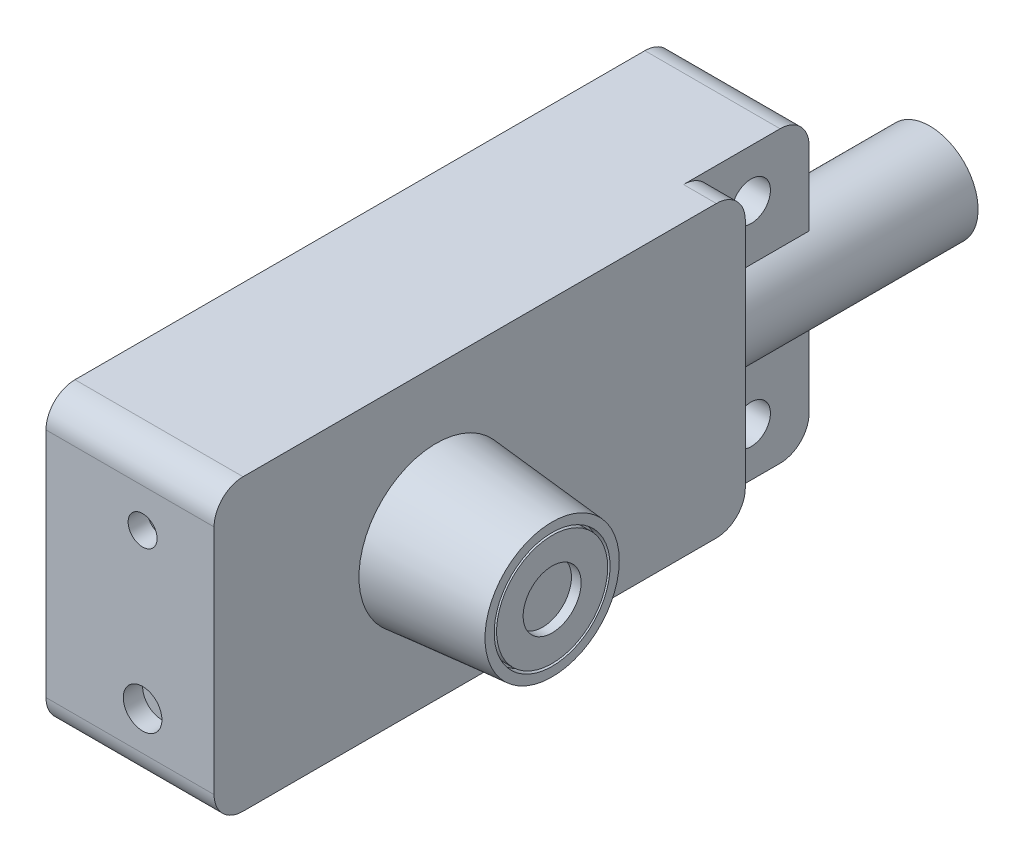
ISO-10303-21;
HEADER;
FILE_DESCRIPTION(('STEP AP214'),'2;1');
FILE_NAME('part.step','',(''),(''),'','','');
FILE_SCHEMA(('AUTOMOTIVE_DESIGN { 1 0 10303 214 1 1 1 1 }'));
ENDSEC;
DATA;
#1=APPLICATION_CONTEXT('core data for automotive mechanical design processes');
#2=APPLICATION_PROTOCOL_DEFINITION('international standard','automotive_design',2000,#1);
#3=PRODUCT_CONTEXT('',#1,'mechanical');
#4=PRODUCT('Part','Part','',(#3));
#5=PRODUCT_RELATED_PRODUCT_CATEGORY('part','',(#4));
#6=PRODUCT_DEFINITION_FORMATION('','',#4);
#7=PRODUCT_DEFINITION_CONTEXT('part definition',#1,'design');
#8=PRODUCT_DEFINITION('design','',#6,#7);
#9=PRODUCT_DEFINITION_SHAPE('','',#8);
#10=(LENGTH_UNIT() NAMED_UNIT(*) SI_UNIT(.MILLI.,.METRE.));
#11=(NAMED_UNIT(*) PLANE_ANGLE_UNIT() SI_UNIT($,.RADIAN.));
#12=(NAMED_UNIT(*) SI_UNIT($,.STERADIAN.) SOLID_ANGLE_UNIT());
#13=UNCERTAINTY_MEASURE_WITH_UNIT(LENGTH_MEASURE(1.E-05),#10,'distance_accuracy_value','');
#14=(GEOMETRIC_REPRESENTATION_CONTEXT(3) GLOBAL_UNCERTAINTY_ASSIGNED_CONTEXT((#13)) GLOBAL_UNIT_ASSIGNED_CONTEXT((#10,
#11,#12)) REPRESENTATION_CONTEXT('',''));
#15=CARTESIAN_POINT('',(0.,0.,0.));
#16=DIRECTION('',(0.,0.,1.));
#17=DIRECTION('',(1.,0.,0.));
#18=AXIS2_PLACEMENT_3D('',#15,#16,#17);
#19=CARTESIAN_POINT('',(0.,0.,-15.));
#20=DIRECTION('',(0.,0.,-1.));
#21=DIRECTION('',(-1.,0.,0.));
#22=AXIS2_PLACEMENT_3D('',#19,#20,#21);
#23=PLANE('',#22);
#24=CARTESIAN_POINT('',(11.5,15.,-15.));
#25=DIRECTION('',(0.,0.,-1.));
#26=DIRECTION('',(-1.,0.,0.));
#27=AXIS2_PLACEMENT_3D('',#24,#25,#26);
#28=CIRCLE('',#27,5.);
#29=CARTESIAN_POINT('',(6.5,15.,-15.));
#30=VERTEX_POINT('',#29);
#31=EDGE_CURVE('E27',#30,#30,#28,.T.);
#32=ORIENTED_EDGE('',*,*,#31,.T.);
#33=EDGE_LOOP('',(#32));
#34=FACE_BOUND('',#33,.T.);
#35=ADVANCED_FACE('F16',(#34),#23,.T.);
#36=CARTESIAN_POINT('',(11.5,15.,0.));
#37=DIRECTION('',(0.,0.,-1.));
#38=DIRECTION('',(-1.,0.,0.));
#39=AXIS2_PLACEMENT_3D('',#36,#37,#38);
#40=CYLINDRICAL_SURFACE('',#39,5.);
#41=ORIENTED_EDGE('',*,*,#31,.F.);
#42=EDGE_LOOP('',(#41));
#43=FACE_BOUND('',#42,.T.);
#44=CARTESIAN_POINT('',(11.5,15.,0.));
#45=DIRECTION('',(0.,0.,-1.));
#46=DIRECTION('',(-1.,0.,0.));
#47=AXIS2_PLACEMENT_3D('',#44,#45,#46);
#48=CIRCLE('',#47,5.);
#49=CARTESIAN_POINT('',(14.,10.6698729810778,0.));
#50=VERTEX_POINT('',#49);
#51=CARTESIAN_POINT('',(14.,19.3301270189222,0.));
#52=VERTEX_POINT('',#51);
#53=EDGE_CURVE('E36',#50,#52,#48,.T.);
#54=ORIENTED_EDGE('',*,*,#53,.T.);
#55=DIRECTION('',(0.,0.,1.));
#56=VECTOR('',#55,1.);
#57=CARTESIAN_POINT('',(14.,19.3301270189222,0.));
#58=LINE('',#57,#56);
#59=CARTESIAN_POINT('',(14.,19.3301270189222,10.));
#60=VERTEX_POINT('',#59);
#61=EDGE_CURVE('E131',#52,#60,#58,.T.);
#62=ORIENTED_EDGE('',*,*,#61,.T.);
#63=CARTESIAN_POINT('',(11.5,15.,10.));
#64=DIRECTION('',(0.,0.,-1.));
#65=DIRECTION('',(-1.,0.,0.));
#66=AXIS2_PLACEMENT_3D('',#63,#64,#65);
#67=CIRCLE('',#66,5.);
#68=CARTESIAN_POINT('',(14.,10.6698729810778,10.));
#69=VERTEX_POINT('',#68);
#70=EDGE_CURVE('E353',#60,#69,#67,.T.);
#71=ORIENTED_EDGE('',*,*,#70,.T.);
#72=DIRECTION('',(0.,0.,1.));
#73=VECTOR('',#72,1.);
#74=CARTESIAN_POINT('',(14.,10.6698729810778,0.));
#75=LINE('',#74,#73);
#76=EDGE_CURVE('E10',#50,#69,#75,.T.);
#77=ORIENTED_EDGE('',*,*,#76,.F.);
#78=EDGE_LOOP('',(#54,#62,#71,#77));
#79=FACE_BOUND('',#78,.T.);
#80=ADVANCED_FACE('F205',(#43,#79),#40,.T.);
#81=CARTESIAN_POINT('',(29.4,0.,0.));
#82=DIRECTION('',(1.,0.,0.));
#83=DIRECTION('',(0.,0.,-1.));
#84=AXIS2_PLACEMENT_3D('',#81,#82,#83);
#85=PLANE('',#84);
#86=CARTESIAN_POINT('',(29.4,15.,42.));
#87=DIRECTION('',(1.,0.,0.));
#88=DIRECTION('',(0.,0.,-1.));
#89=AXIS2_PLACEMENT_3D('',#86,#87,#88);
#90=CIRCLE('',#89,5.75);
#91=CARTESIAN_POINT('',(29.4,15.,36.25));
#92=VERTEX_POINT('',#91);
#93=EDGE_CURVE('E354',#92,#92,#90,.T.);
#94=ORIENTED_EDGE('',*,*,#93,.T.);
#95=EDGE_LOOP('',(#94));
#96=FACE_BOUND('',#95,.T.);
#97=CARTESIAN_POINT('',(29.4,15.,42.));
#98=DIRECTION('',(1.,0.,0.));
#99=DIRECTION('',(0.,0.,-1.));
#100=AXIS2_PLACEMENT_3D('',#97,#98,#99);
#101=CIRCLE('',#100,3.);
#102=CARTESIAN_POINT('',(29.4,15.,39.));
#103=VERTEX_POINT('',#102);
#104=EDGE_CURVE('E358',#103,#103,#101,.T.);
#105=ORIENTED_EDGE('',*,*,#104,.F.);
#106=EDGE_LOOP('',(#105));
#107=FACE_BOUND('',#106,.T.);
#108=ADVANCED_FACE('F211',(#96,#107),#85,.T.);
#109=CARTESIAN_POINT('',(28.9,15.,42.));
#110=DIRECTION('',(1.,0.,0.));
#111=DIRECTION('',(0.,0.,-1.));
#112=AXIS2_PLACEMENT_3D('',#109,#110,#111);
#113=CYLINDRICAL_SURFACE('',#112,5.75);
#114=CARTESIAN_POINT('',(28.4,15.,42.));
#115=DIRECTION('',(1.,0.,0.));
#116=DIRECTION('',(0.,0.,-1.));
#117=AXIS2_PLACEMENT_3D('',#114,#115,#116);
#118=CIRCLE('',#117,5.75);
#119=CARTESIAN_POINT('',(28.4,15.,36.25));
#120=VERTEX_POINT('',#119);
#121=EDGE_CURVE('E363',#120,#120,#118,.T.);
#122=ORIENTED_EDGE('',*,*,#121,.T.);
#123=EDGE_LOOP('',(#122));
#124=FACE_BOUND('',#123,.T.);
#125=ORIENTED_EDGE('',*,*,#93,.F.);
#126=EDGE_LOOP('',(#125));
#127=FACE_BOUND('',#126,.T.);
#128=ADVANCED_FACE('F218',(#124,#127),#113,.T.);
#129=CARTESIAN_POINT('',(28.9,15.,42.));
#130=DIRECTION('',(1.,0.,0.));
#131=DIRECTION('',(0.,0.,-1.));
#132=AXIS2_PLACEMENT_3D('',#129,#130,#131);
#133=CYLINDRICAL_SURFACE('',#132,3.);
#134=CARTESIAN_POINT('',(28.4,15.,42.));
#135=DIRECTION('',(1.,0.,0.));
#136=DIRECTION('',(0.,0.,-1.));
#137=AXIS2_PLACEMENT_3D('',#134,#135,#136);
#138=CIRCLE('',#137,3.);
#139=CARTESIAN_POINT('',(28.4,15.,39.));
#140=VERTEX_POINT('',#139);
#141=EDGE_CURVE('E359',#140,#140,#138,.T.);
#142=ORIENTED_EDGE('',*,*,#141,.F.);
#143=EDGE_LOOP('',(#142));
#144=FACE_BOUND('',#143,.T.);
#145=ORIENTED_EDGE('',*,*,#104,.T.);
#146=EDGE_LOOP('',(#145));
#147=FACE_BOUND('',#146,.T.);
#148=ADVANCED_FACE('F222',(#144,#147),#133,.F.);
#149=CARTESIAN_POINT('',(28.4,0.,0.));
#150=DIRECTION('',(1.,0.,0.));
#151=DIRECTION('',(0.,0.,-1.));
#152=AXIS2_PLACEMENT_3D('',#149,#150,#151);
#153=PLANE('',#152);
#154=CARTESIAN_POINT('',(28.4,15.,42.));
#155=DIRECTION('',(1.,0.,0.));
#156=DIRECTION('',(0.,0.,-1.));
#157=AXIS2_PLACEMENT_3D('',#154,#155,#156);
#158=CIRCLE('',#157,6.);
#159=CARTESIAN_POINT('',(28.4,15.,36.));
#160=VERTEX_POINT('',#159);
#161=EDGE_CURVE('E367',#160,#160,#158,.T.);
#162=ORIENTED_EDGE('',*,*,#161,.T.);
#163=EDGE_LOOP('',(#162));
#164=FACE_BOUND('',#163,.T.);
#165=ORIENTED_EDGE('',*,*,#121,.F.);
#166=EDGE_LOOP('',(#165));
#167=FACE_BOUND('',#166,.T.);
#168=ADVANCED_FACE('F226',(#164,#167),#153,.T.);
#169=CARTESIAN_POINT('',(28.4,0.,0.));
#170=DIRECTION('',(1.,0.,0.));
#171=DIRECTION('',(0.,0.,-1.));
#172=AXIS2_PLACEMENT_3D('',#169,#170,#171);
#173=PLANE('',#172);
#174=ORIENTED_EDGE('',*,*,#141,.T.);
#175=EDGE_LOOP('',(#174));
#176=FACE_BOUND('',#175,.T.);
#177=ADVANCED_FACE('F230',(#176),#173,.T.);
#178=CARTESIAN_POINT('',(28.9,15.,42.));
#179=DIRECTION('',(1.,0.,0.));
#180=DIRECTION('',(0.,0.,-1.));
#181=AXIS2_PLACEMENT_3D('',#178,#179,#180);
#182=CYLINDRICAL_SURFACE('',#181,6.);
#183=ORIENTED_EDGE('',*,*,#161,.F.);
#184=EDGE_LOOP('',(#183));
#185=FACE_BOUND('',#184,.T.);
#186=CARTESIAN_POINT('',(29.4,15.,42.));
#187=DIRECTION('',(1.,0.,0.));
#188=DIRECTION('',(0.,0.,-1.));
#189=AXIS2_PLACEMENT_3D('',#186,#187,#188);
#190=CIRCLE('',#189,6.);
#191=CARTESIAN_POINT('',(29.4,15.,36.));
#192=VERTEX_POINT('',#191);
#193=EDGE_CURVE('E374',#192,#192,#190,.T.);
#194=ORIENTED_EDGE('',*,*,#193,.T.);
#195=EDGE_LOOP('',(#194));
#196=FACE_BOUND('',#195,.T.);
#197=ADVANCED_FACE('F234',(#185,#196),#182,.F.);
#198=CARTESIAN_POINT('',(29.4,0.,0.));
#199=DIRECTION('',(1.,0.,0.));
#200=DIRECTION('',(0.,0.,-1.));
#201=AXIS2_PLACEMENT_3D('',#198,#199,#200);
#202=PLANE('',#201);
#203=CARTESIAN_POINT('',(29.4,15.,42.));
#204=DIRECTION('',(1.,0.,0.));
#205=DIRECTION('',(0.,0.,-1.));
#206=AXIS2_PLACEMENT_3D('',#203,#204,#205);
#207=CIRCLE('',#206,6.95013603768891);
#208=CARTESIAN_POINT('',(29.4,15.,35.0498639623111));
#209=VERTEX_POINT('',#208);
#210=EDGE_CURVE('E378',#209,#209,#207,.T.);
#211=ORIENTED_EDGE('',*,*,#210,.T.);
#212=EDGE_LOOP('',(#211));
#213=FACE_BOUND('',#212,.T.);
#214=ORIENTED_EDGE('',*,*,#193,.F.);
#215=EDGE_LOOP('',(#214));
#216=FACE_BOUND('',#215,.T.);
#217=ADVANCED_FACE('F238',(#213,#216),#202,.T.);
#218=CARTESIAN_POINT('',(108.840418422091,15.,42.));
#219=DIRECTION('',(-1.,0.,0.));
#220=DIRECTION('',(0.,0.,1.));
#221=AXIS2_PLACEMENT_3D('',#218,#219,#220);
#222=CONICAL_SURFACE('',#221,0.,0.0872664625997164);
#223=CARTESIAN_POINT('',(17.4,15.,42.));
#224=DIRECTION('',(1.,0.,0.));
#225=DIRECTION('',(0.,0.,-1.));
#226=AXIS2_PLACEMENT_3D('',#223,#224,#225);
#227=CIRCLE('',#226,8.);
#228=CARTESIAN_POINT('',(17.4,15.,34.));
#229=VERTEX_POINT('',#228);
#230=EDGE_CURVE('E383',#229,#229,#227,.T.);
#231=ORIENTED_EDGE('',*,*,#230,.T.);
#232=EDGE_LOOP('',(#231));
#233=FACE_BOUND('',#232,.T.);
#234=ORIENTED_EDGE('',*,*,#210,.F.);
#235=EDGE_LOOP('',(#234));
#236=FACE_BOUND('',#235,.T.);
#237=ADVANCED_FACE('F242',(#233,#236),#222,.T.);
#238=CARTESIAN_POINT('',(17.4,0.,0.));
#239=DIRECTION('',(1.,0.,0.));
#240=DIRECTION('',(0.,0.,-1.));
#241=AXIS2_PLACEMENT_3D('',#238,#239,#240);
#242=PLANE('',#241);
#243=CARTESIAN_POINT('',(17.4,3.,62.));
#244=DIRECTION('',(-1.,0.,0.));
#245=DIRECTION('',(0.,0.,-1.));
#246=AXIS2_PLACEMENT_3D('',#243,#244,#245);
#247=CIRCLE('',#246,3.);
#248=CARTESIAN_POINT('',(17.4,0.,62.));
#249=VERTEX_POINT('',#248);
#250=CARTESIAN_POINT('',(17.4,3.,65.));
#251=VERTEX_POINT('',#250);
#252=EDGE_CURVE('E382',#249,#251,#247,.T.);
#253=ORIENTED_EDGE('',*,*,#252,.F.);
#254=DIRECTION('',(0.,0.,-1.));
#255=VECTOR('',#254,1.);
#256=CARTESIAN_POINT('',(17.4,0.,37.5));
#257=LINE('',#256,#255);
#258=CARTESIAN_POINT('',(17.4,0.,13.));
#259=VERTEX_POINT('',#258);
#260=EDGE_CURVE('E415',#249,#259,#257,.T.);
#261=ORIENTED_EDGE('',*,*,#260,.T.);
#262=CARTESIAN_POINT('',(17.4,3.,13.));
#263=DIRECTION('',(-1.,0.,0.));
#264=DIRECTION('',(0.,0.,-1.));
#265=AXIS2_PLACEMENT_3D('',#262,#263,#264);
#266=CIRCLE('',#265,3.);
#267=CARTESIAN_POINT('',(17.4,3.,10.));
#268=VERTEX_POINT('',#267);
#269=EDGE_CURVE('E387',#268,#259,#266,.T.);
#270=ORIENTED_EDGE('',*,*,#269,.F.);
#271=DIRECTION('',(0.,1.,0.));
#272=VECTOR('',#271,1.);
#273=CARTESIAN_POINT('',(17.4,15.,10.));
#274=LINE('',#273,#272);
#275=CARTESIAN_POINT('',(17.4,27.,10.));
#276=VERTEX_POINT('',#275);
#277=EDGE_CURVE('E407',#268,#276,#274,.T.);
#278=ORIENTED_EDGE('',*,*,#277,.T.);
#279=CARTESIAN_POINT('',(17.4,27.,13.));
#280=DIRECTION('',(-1.,0.,0.));
#281=DIRECTION('',(0.,0.,-1.));
#282=AXIS2_PLACEMENT_3D('',#279,#280,#281);
#283=CIRCLE('',#282,3.);
#284=CARTESIAN_POINT('',(17.4,30.,13.));
#285=VERTEX_POINT('',#284);
#286=EDGE_CURVE('E398',#285,#276,#283,.T.);
#287=ORIENTED_EDGE('',*,*,#286,.F.);
#288=DIRECTION('',(0.,0.,1.));
#289=VECTOR('',#288,1.);
#290=CARTESIAN_POINT('',(17.4,30.,37.5));
#291=LINE('',#290,#289);
#292=CARTESIAN_POINT('',(17.4,30.,62.));
#293=VERTEX_POINT('',#292);
#294=EDGE_CURVE('E399',#285,#293,#291,.T.);
#295=ORIENTED_EDGE('',*,*,#294,.T.);
#296=CARTESIAN_POINT('',(17.4,27.,62.));
#297=DIRECTION('',(-1.,0.,0.));
#298=DIRECTION('',(0.,0.,-1.));
#299=AXIS2_PLACEMENT_3D('',#296,#297,#298);
#300=CIRCLE('',#299,3.);
#301=CARTESIAN_POINT('',(17.4,27.,65.));
#302=VERTEX_POINT('',#301);
#303=EDGE_CURVE('E392',#302,#293,#300,.T.);
#304=ORIENTED_EDGE('',*,*,#303,.F.);
#305=DIRECTION('',(0.,-1.,0.));
#306=VECTOR('',#305,1.);
#307=CARTESIAN_POINT('',(17.4,15.,65.));
#308=LINE('',#307,#306);
#309=EDGE_CURVE('E165',#302,#251,#308,.T.);
#310=ORIENTED_EDGE('',*,*,#309,.T.);
#311=EDGE_LOOP('',(#253,#261,#270,#278,#287,#295,#304,#310));
#312=FACE_BOUND('',#311,.T.);
#313=ORIENTED_EDGE('',*,*,#230,.F.);
#314=EDGE_LOOP('',(#313));
#315=FACE_BOUND('',#314,.T.);
#316=ADVANCED_FACE('F246',(#312,#315),#242,.T.);
#317=CARTESIAN_POINT('',(0.,0.,65.));
#318=DIRECTION('',(0.,-1.,0.));
#319=DIRECTION('',(0.,0.,-1.));
#320=AXIS2_PLACEMENT_3D('',#317,#318,#319);
#321=PLANE('',#320);
#322=DIRECTION('',(1.,0.,0.));
#323=VECTOR('',#322,1.);
#324=CARTESIAN_POINT('',(8.7,0.,62.));
#325=LINE('',#324,#323);
#326=CARTESIAN_POINT('',(0.,0.,62.));
#327=VERTEX_POINT('',#326);
#328=EDGE_CURVE('E388',#327,#249,#325,.T.);
#329=ORIENTED_EDGE('',*,*,#328,.F.);
#330=DIRECTION('',(0.,0.,-1.));
#331=VECTOR('',#330,1.);
#332=CARTESIAN_POINT('',(0.,0.,32.5));
#333=LINE('',#332,#331);
#334=CARTESIAN_POINT('',(0.,0.,3.00000000000001));
#335=VERTEX_POINT('',#334);
#336=EDGE_CURVE('E432',#327,#335,#333,.T.);
#337=ORIENTED_EDGE('',*,*,#336,.T.);
#338=DIRECTION('',(1.,0.,0.));
#339=VECTOR('',#338,1.);
#340=CARTESIAN_POINT('',(7.,0.,3.));
#341=LINE('',#340,#339);
#342=CARTESIAN_POINT('',(14.,0.,3.));
#343=VERTEX_POINT('',#342);
#344=EDGE_CURVE('E330',#335,#343,#341,.T.);
#345=ORIENTED_EDGE('',*,*,#344,.T.);
#346=DIRECTION('',(0.,0.,-1.));
#347=VECTOR('',#346,1.);
#348=CARTESIAN_POINT('',(14.,0.,8.));
#349=LINE('',#348,#347);
#350=CARTESIAN_POINT('',(14.,0.,13.));
#351=VERTEX_POINT('',#350);
#352=EDGE_CURVE('E418',#351,#343,#349,.T.);
#353=ORIENTED_EDGE('',*,*,#352,.F.);
#354=DIRECTION('',(1.,0.,0.));
#355=VECTOR('',#354,1.);
#356=CARTESIAN_POINT('',(15.7,0.,13.));
#357=LINE('',#356,#355);
#358=EDGE_CURVE('E422',#351,#259,#357,.T.);
#359=ORIENTED_EDGE('',*,*,#358,.T.);
#360=ORIENTED_EDGE('',*,*,#260,.F.);
#361=EDGE_LOOP('',(#329,#337,#345,#353,#359,#360));
#362=FACE_BOUND('',#361,.T.);
#363=ADVANCED_FACE('F250',(#362),#321,.T.);
#364=CARTESIAN_POINT('',(8.7,3.,13.));
#365=DIRECTION('',(1.,0.,0.));
#366=DIRECTION('',(0.,0.,-1.));
#367=AXIS2_PLACEMENT_3D('',#364,#365,#366);
#368=CYLINDRICAL_SURFACE('',#367,3.);
#369=DIRECTION('',(1.,0.,0.));
#370=VECTOR('',#369,1.);
#371=CARTESIAN_POINT('',(8.7,3.,10.));
#372=LINE('',#371,#370);
#373=CARTESIAN_POINT('',(14.,3.,10.));
#374=VERTEX_POINT('',#373);
#375=EDGE_CURVE('E410',#374,#268,#372,.T.);
#376=ORIENTED_EDGE('',*,*,#375,.T.);
#377=ORIENTED_EDGE('',*,*,#269,.T.);
#378=ORIENTED_EDGE('',*,*,#358,.F.);
#379=CARTESIAN_POINT('',(14.,3.,13.));
#380=DIRECTION('',(1.,0.,0.));
#381=DIRECTION('',(0.,0.,-1.));
#382=AXIS2_PLACEMENT_3D('',#379,#380,#381);
#383=CIRCLE('',#382,3.);
#384=EDGE_CURVE('E331',#351,#374,#383,.T.);
#385=ORIENTED_EDGE('',*,*,#384,.T.);
#386=EDGE_LOOP('',(#376,#377,#378,#385));
#387=FACE_BOUND('',#386,.T.);
#388=ADVANCED_FACE('F254',(#387),#368,.T.);
#389=CARTESIAN_POINT('',(14.,0.,10.));
#390=DIRECTION('',(0.,0.,-1.));
#391=DIRECTION('',(-1.,0.,0.));
#392=AXIS2_PLACEMENT_3D('',#389,#390,#391);
#393=PLANE('',#392);
#394=DIRECTION('',(0.,1.,0.));
#395=VECTOR('',#394,1.);
#396=CARTESIAN_POINT('',(14.,23.1650635094611,10.));
#397=LINE('',#396,#395);
#398=CARTESIAN_POINT('',(14.,27.,10.));
#399=VERTEX_POINT('',#398);
#400=EDGE_CURVE('E344',#60,#399,#397,.T.);
#401=ORIENTED_EDGE('',*,*,#400,.T.);
#402=DIRECTION('',(1.,0.,0.));
#403=VECTOR('',#402,1.);
#404=CARTESIAN_POINT('',(15.7,27.,10.));
#405=LINE('',#404,#403);
#406=EDGE_CURVE('E411',#399,#276,#405,.T.);
#407=ORIENTED_EDGE('',*,*,#406,.T.);
#408=ORIENTED_EDGE('',*,*,#277,.F.);
#409=ORIENTED_EDGE('',*,*,#375,.F.);
#410=DIRECTION('',(0.,1.,0.));
#411=VECTOR('',#410,1.);
#412=CARTESIAN_POINT('',(14.,6.8349364905389,10.));
#413=LINE('',#412,#411);
#414=EDGE_CURVE('E337',#374,#69,#413,.T.);
#415=ORIENTED_EDGE('',*,*,#414,.T.);
#416=ORIENTED_EDGE('',*,*,#70,.F.);
#417=EDGE_LOOP('',(#401,#407,#408,#409,#415,#416));
#418=FACE_BOUND('',#417,.T.);
#419=ADVANCED_FACE('F258',(#418),#393,.T.);
#420=CARTESIAN_POINT('',(8.7,27.,13.));
#421=DIRECTION('',(1.,0.,0.));
#422=DIRECTION('',(0.,0.,-1.));
#423=AXIS2_PLACEMENT_3D('',#420,#421,#422);
#424=CYLINDRICAL_SURFACE('',#423,3.);
#425=DIRECTION('',(1.,0.,0.));
#426=VECTOR('',#425,1.);
#427=CARTESIAN_POINT('',(8.7,30.,13.));
#428=LINE('',#427,#426);
#429=CARTESIAN_POINT('',(14.,30.,13.));
#430=VERTEX_POINT('',#429);
#431=EDGE_CURVE('E402',#430,#285,#428,.T.);
#432=ORIENTED_EDGE('',*,*,#431,.T.);
#433=ORIENTED_EDGE('',*,*,#286,.T.);
#434=ORIENTED_EDGE('',*,*,#406,.F.);
#435=CARTESIAN_POINT('',(14.,27.,13.));
#436=DIRECTION('',(1.,0.,0.));
#437=DIRECTION('',(0.,0.,-1.));
#438=AXIS2_PLACEMENT_3D('',#435,#436,#437);
#439=CIRCLE('',#438,3.);
#440=EDGE_CURVE('E144',#399,#430,#439,.T.);
#441=ORIENTED_EDGE('',*,*,#440,.T.);
#442=EDGE_LOOP('',(#432,#433,#434,#441));
#443=FACE_BOUND('',#442,.T.);
#444=ADVANCED_FACE('F262',(#443),#424,.T.);
#445=CARTESIAN_POINT('',(0.,30.,0.));
#446=DIRECTION('',(0.,1.,0.));
#447=DIRECTION('',(0.,0.,1.));
#448=AXIS2_PLACEMENT_3D('',#445,#446,#447);
#449=PLANE('',#448);
#450=DIRECTION('',(1.,0.,0.));
#451=VECTOR('',#450,1.);
#452=CARTESIAN_POINT('',(8.7,30.,62.));
#453=LINE('',#452,#451);
#454=CARTESIAN_POINT('',(0.,30.,62.));
#455=VERTEX_POINT('',#454);
#456=EDGE_CURVE('E403',#455,#293,#453,.T.);
#457=ORIENTED_EDGE('',*,*,#456,.T.);
#458=ORIENTED_EDGE('',*,*,#294,.F.);
#459=ORIENTED_EDGE('',*,*,#431,.F.);
#460=DIRECTION('',(0.,0.,1.));
#461=VECTOR('',#460,1.);
#462=CARTESIAN_POINT('',(14.,30.,8.));
#463=LINE('',#462,#461);
#464=CARTESIAN_POINT('',(14.,30.,3.));
#465=VERTEX_POINT('',#464);
#466=EDGE_CURVE('E449',#465,#430,#463,.T.);
#467=ORIENTED_EDGE('',*,*,#466,.F.);
#468=DIRECTION('',(1.,0.,0.));
#469=VECTOR('',#468,1.);
#470=CARTESIAN_POINT('',(7.,30.,3.));
#471=LINE('',#470,#469);
#472=CARTESIAN_POINT('',(0.,30.,3.));
#473=VERTEX_POINT('',#472);
#474=EDGE_CURVE('E142',#473,#465,#471,.T.);
#475=ORIENTED_EDGE('',*,*,#474,.F.);
#476=DIRECTION('',(0.,0.,1.));
#477=VECTOR('',#476,1.);
#478=CARTESIAN_POINT('',(0.,30.,32.5));
#479=LINE('',#478,#477);
#480=EDGE_CURVE('E455',#473,#455,#479,.T.);
#481=ORIENTED_EDGE('',*,*,#480,.T.);
#482=EDGE_LOOP('',(#457,#458,#459,#467,#475,#481));
#483=FACE_BOUND('',#482,.T.);
#484=ADVANCED_FACE('F266',(#483),#449,.T.);
#485=CARTESIAN_POINT('',(8.7,27.,62.));
#486=DIRECTION('',(1.,0.,0.));
#487=DIRECTION('',(0.,0.,-1.));
#488=AXIS2_PLACEMENT_3D('',#485,#486,#487);
#489=CYLINDRICAL_SURFACE('',#488,3.);
#490=DIRECTION('',(1.,0.,0.));
#491=VECTOR('',#490,1.);
#492=CARTESIAN_POINT('',(8.7,27.,65.));
#493=LINE('',#492,#491);
#494=CARTESIAN_POINT('',(0.,27.,65.));
#495=VERTEX_POINT('',#494);
#496=EDGE_CURVE('E312',#495,#302,#493,.T.);
#497=ORIENTED_EDGE('',*,*,#496,.T.);
#498=ORIENTED_EDGE('',*,*,#303,.T.);
#499=ORIENTED_EDGE('',*,*,#456,.F.);
#500=CARTESIAN_POINT('',(0.,27.,62.));
#501=DIRECTION('',(1.,0.,0.));
#502=DIRECTION('',(0.,0.,-1.));
#503=AXIS2_PLACEMENT_3D('',#500,#501,#502);
#504=CIRCLE('',#503,3.);
#505=EDGE_CURVE('E459',#455,#495,#504,.T.);
#506=ORIENTED_EDGE('',*,*,#505,.T.);
#507=EDGE_LOOP('',(#497,#498,#499,#506));
#508=FACE_BOUND('',#507,.T.);
#509=ADVANCED_FACE('F270',(#508),#489,.T.);
#510=CARTESIAN_POINT('',(8.7,3.,62.));
#511=DIRECTION('',(1.,0.,0.));
#512=DIRECTION('',(0.,0.,-1.));
#513=AXIS2_PLACEMENT_3D('',#510,#511,#512);
#514=CYLINDRICAL_SURFACE('',#513,3.);
#515=ORIENTED_EDGE('',*,*,#328,.T.);
#516=ORIENTED_EDGE('',*,*,#252,.T.);
#517=DIRECTION('',(1.,0.,0.));
#518=VECTOR('',#517,1.);
#519=CARTESIAN_POINT('',(8.7,3.,65.));
#520=LINE('',#519,#518);
#521=CARTESIAN_POINT('',(0.,3.00000000000001,65.));
#522=VERTEX_POINT('',#521);
#523=EDGE_CURVE('E436',#522,#251,#520,.T.);
#524=ORIENTED_EDGE('',*,*,#523,.F.);
#525=CARTESIAN_POINT('',(0.,3.,62.));
#526=DIRECTION('',(1.,0.,0.));
#527=DIRECTION('',(0.,0.,-1.));
#528=AXIS2_PLACEMENT_3D('',#525,#526,#527);
#529=CIRCLE('',#528,3.);
#530=EDGE_CURVE('E431',#522,#327,#529,.T.);
#531=ORIENTED_EDGE('',*,*,#530,.T.);
#532=EDGE_LOOP('',(#515,#516,#524,#531));
#533=FACE_BOUND('',#532,.T.);
#534=ADVANCED_FACE('F274',(#533),#514,.T.);
#535=CARTESIAN_POINT('',(0.,0.,0.));
#536=DIRECTION('',(1.,0.,0.));
#537=DIRECTION('',(0.,0.,-1.));
#538=AXIS2_PLACEMENT_3D('',#535,#536,#537);
#539=PLANE('',#538);
#540=ORIENTED_EDGE('',*,*,#336,.F.);
#541=ORIENTED_EDGE('',*,*,#530,.F.);
#542=DIRECTION('',(0.,-1.,0.));
#543=VECTOR('',#542,1.);
#544=CARTESIAN_POINT('',(0.,15.,65.));
#545=LINE('',#544,#543);
#546=EDGE_CURVE('E467',#495,#522,#545,.T.);
#547=ORIENTED_EDGE('',*,*,#546,.F.);
#548=ORIENTED_EDGE('',*,*,#505,.F.);
#549=ORIENTED_EDGE('',*,*,#480,.F.);
#550=CARTESIAN_POINT('',(0.,27.,3.));
#551=DIRECTION('',(1.,0.,0.));
#552=DIRECTION('',(0.,0.,-1.));
#553=AXIS2_PLACEMENT_3D('',#550,#551,#552);
#554=CIRCLE('',#553,3.);
#555=CARTESIAN_POINT('',(0.,27.,0.));
#556=VERTEX_POINT('',#555);
#557=EDGE_CURVE('E458',#556,#473,#554,.T.);
#558=ORIENTED_EDGE('',*,*,#557,.F.);
#559=DIRECTION('',(0.,1.,0.));
#560=VECTOR('',#559,1.);
#561=CARTESIAN_POINT('',(0.,15.,0.));
#562=LINE('',#561,#560);
#563=CARTESIAN_POINT('',(0.,3.,0.));
#564=VERTEX_POINT('',#563);
#565=EDGE_CURVE('E149',#564,#556,#562,.T.);
#566=ORIENTED_EDGE('',*,*,#565,.F.);
#567=CARTESIAN_POINT('',(0.,3.,3.));
#568=DIRECTION('',(1.,0.,0.));
#569=DIRECTION('',(0.,0.,-1.));
#570=AXIS2_PLACEMENT_3D('',#567,#568,#569);
#571=CIRCLE('',#570,3.);
#572=EDGE_CURVE('E437',#335,#564,#571,.T.);
#573=ORIENTED_EDGE('',*,*,#572,.F.);
#574=EDGE_LOOP('',(#540,#541,#547,#548,#549,#558,#566,#573));
#575=FACE_BOUND('',#574,.T.);
#576=CARTESIAN_POINT('',(0.,5.00000000000001,6.));
#577=DIRECTION('',(1.,0.,0.));
#578=DIRECTION('',(0.,0.,-1.));
#579=AXIS2_PLACEMENT_3D('',#576,#577,#578);
#580=CIRCLE('',#579,2.);
#581=CARTESIAN_POINT('',(0.,5.00000000000001,4.));
#582=VERTEX_POINT('',#581);
#583=EDGE_CURVE('E311',#582,#582,#580,.T.);
#584=ORIENTED_EDGE('',*,*,#583,.T.);
#585=EDGE_LOOP('',(#584));
#586=FACE_BOUND('',#585,.T.);
#587=CARTESIAN_POINT('',(0.,25.,6.));
#588=DIRECTION('',(1.,0.,0.));
#589=DIRECTION('',(0.,0.,-1.));
#590=AXIS2_PLACEMENT_3D('',#587,#588,#589);
#591=CIRCLE('',#590,2.);
#592=CARTESIAN_POINT('',(0.,25.,4.));
#593=VERTEX_POINT('',#592);
#594=EDGE_CURVE('E308',#593,#593,#591,.T.);
#595=ORIENTED_EDGE('',*,*,#594,.T.);
#596=EDGE_LOOP('',(#595));
#597=FACE_BOUND('',#596,.T.);
#598=ADVANCED_FACE('F278',(#575,#586,#597),#539,.F.);
#599=CARTESIAN_POINT('',(8.7,3.,3.));
#600=DIRECTION('',(1.,0.,0.));
#601=DIRECTION('',(0.,0.,-1.));
#602=AXIS2_PLACEMENT_3D('',#599,#600,#601);
#603=CYLINDRICAL_SURFACE('',#602,3.);
#604=DIRECTION('',(1.,0.,0.));
#605=VECTOR('',#604,1.);
#606=CARTESIAN_POINT('',(8.7,3.,0.));
#607=LINE('',#606,#605);
#608=CARTESIAN_POINT('',(14.,3.,0.));
#609=VERTEX_POINT('',#608);
#610=EDGE_CURVE('E117',#564,#609,#607,.T.);
#611=ORIENTED_EDGE('',*,*,#610,.T.);
#612=CARTESIAN_POINT('',(14.,3.,3.));
#613=DIRECTION('',(-1.,0.,0.));
#614=DIRECTION('',(0.,0.,-1.));
#615=AXIS2_PLACEMENT_3D('',#612,#613,#614);
#616=CIRCLE('',#615,3.);
#617=EDGE_CURVE('E327',#609,#343,#616,.T.);
#618=ORIENTED_EDGE('',*,*,#617,.T.);
#619=ORIENTED_EDGE('',*,*,#344,.F.);
#620=ORIENTED_EDGE('',*,*,#572,.T.);
#621=EDGE_LOOP('',(#611,#618,#619,#620));
#622=FACE_BOUND('',#621,.T.);
#623=ADVANCED_FACE('F282',(#622),#603,.T.);
#624=CARTESIAN_POINT('',(14.,0.,0.));
#625=DIRECTION('',(1.,0.,0.));
#626=DIRECTION('',(0.,0.,-1.));
#627=AXIS2_PLACEMENT_3D('',#624,#625,#626);
#628=PLANE('',#627);
#629=ORIENTED_EDGE('',*,*,#76,.T.);
#630=ORIENTED_EDGE('',*,*,#414,.F.);
#631=ORIENTED_EDGE('',*,*,#384,.F.);
#632=ORIENTED_EDGE('',*,*,#352,.T.);
#633=ORIENTED_EDGE('',*,*,#617,.F.);
#634=DIRECTION('',(0.,1.,0.));
#635=VECTOR('',#634,1.);
#636=CARTESIAN_POINT('',(14.,6.8349364905389,0.));
#637=LINE('',#636,#635);
#638=EDGE_CURVE('E318',#609,#50,#637,.T.);
#639=ORIENTED_EDGE('',*,*,#638,.T.);
#640=EDGE_LOOP('',(#629,#630,#631,#632,#633,#639));
#641=FACE_BOUND('',#640,.T.);
#642=CARTESIAN_POINT('',(14.,5.00000000000001,6.));
#643=DIRECTION('',(1.,0.,0.));
#644=DIRECTION('',(0.,0.,-1.));
#645=AXIS2_PLACEMENT_3D('',#642,#643,#644);
#646=CIRCLE('',#645,2.);
#647=CARTESIAN_POINT('',(14.,5.00000000000001,4.));
#648=VERTEX_POINT('',#647);
#649=EDGE_CURVE('E335',#648,#648,#646,.T.);
#650=ORIENTED_EDGE('',*,*,#649,.F.);
#651=EDGE_LOOP('',(#650));
#652=FACE_BOUND('',#651,.T.);
#653=ADVANCED_FACE('F286',(#641,#652),#628,.T.);
#654=CARTESIAN_POINT('',(14.,0.,0.));
#655=DIRECTION('',(1.,0.,0.));
#656=DIRECTION('',(0.,0.,-1.));
#657=AXIS2_PLACEMENT_3D('',#654,#655,#656);
#658=PLANE('',#657);
#659=ORIENTED_EDGE('',*,*,#61,.F.);
#660=DIRECTION('',(0.,1.,0.));
#661=VECTOR('',#660,1.);
#662=CARTESIAN_POINT('',(14.,23.1650635094611,0.));
#663=LINE('',#662,#661);
#664=CARTESIAN_POINT('',(14.,27.,0.));
#665=VERTEX_POINT('',#664);
#666=EDGE_CURVE('E123',#52,#665,#663,.T.);
#667=ORIENTED_EDGE('',*,*,#666,.T.);
#668=CARTESIAN_POINT('',(14.,27.,3.));
#669=DIRECTION('',(-1.,0.,0.));
#670=DIRECTION('',(0.,0.,-1.));
#671=AXIS2_PLACEMENT_3D('',#668,#669,#670);
#672=CIRCLE('',#671,3.);
#673=EDGE_CURVE('E128',#465,#665,#672,.T.);
#674=ORIENTED_EDGE('',*,*,#673,.F.);
#675=ORIENTED_EDGE('',*,*,#466,.T.);
#676=ORIENTED_EDGE('',*,*,#440,.F.);
#677=ORIENTED_EDGE('',*,*,#400,.F.);
#678=EDGE_LOOP('',(#659,#667,#674,#675,#676,#677));
#679=FACE_BOUND('',#678,.T.);
#680=CARTESIAN_POINT('',(14.,25.,6.));
#681=DIRECTION('',(1.,0.,0.));
#682=DIRECTION('',(0.,0.,-1.));
#683=AXIS2_PLACEMENT_3D('',#680,#681,#682);
#684=CIRCLE('',#683,2.);
#685=CARTESIAN_POINT('',(14.,25.,4.));
#686=VERTEX_POINT('',#685);
#687=EDGE_CURVE('E145',#686,#686,#684,.T.);
#688=ORIENTED_EDGE('',*,*,#687,.F.);
#689=EDGE_LOOP('',(#688));
#690=FACE_BOUND('',#689,.T.);
#691=ADVANCED_FACE('F125',(#679,#690),#658,.T.);
#692=CARTESIAN_POINT('',(8.7,27.,3.));
#693=DIRECTION('',(1.,0.,0.));
#694=DIRECTION('',(0.,0.,-1.));
#695=AXIS2_PLACEMENT_3D('',#692,#693,#694);
#696=CYLINDRICAL_SURFACE('',#695,3.);
#697=ORIENTED_EDGE('',*,*,#474,.T.);
#698=ORIENTED_EDGE('',*,*,#673,.T.);
#699=DIRECTION('',(1.,0.,0.));
#700=VECTOR('',#699,1.);
#701=CARTESIAN_POINT('',(8.7,27.,0.));
#702=LINE('',#701,#700);
#703=EDGE_CURVE('E140',#556,#665,#702,.T.);
#704=ORIENTED_EDGE('',*,*,#703,.F.);
#705=ORIENTED_EDGE('',*,*,#557,.T.);
#706=EDGE_LOOP('',(#697,#698,#704,#705));
#707=FACE_BOUND('',#706,.T.);
#708=ADVANCED_FACE('F138',(#707),#696,.T.);
#709=CARTESIAN_POINT('',(0.,0.,0.));
#710=DIRECTION('',(0.,0.,-1.));
#711=DIRECTION('',(-1.,0.,0.));
#712=AXIS2_PLACEMENT_3D('',#709,#710,#711);
#713=PLANE('',#712);
#714=ORIENTED_EDGE('',*,*,#53,.F.);
#715=ORIENTED_EDGE('',*,*,#638,.F.);
#716=ORIENTED_EDGE('',*,*,#610,.F.);
#717=ORIENTED_EDGE('',*,*,#565,.T.);
#718=ORIENTED_EDGE('',*,*,#703,.T.);
#719=ORIENTED_EDGE('',*,*,#666,.F.);
#720=EDGE_LOOP('',(#714,#715,#716,#717,#718,#719));
#721=FACE_BOUND('',#720,.T.);
#722=ADVANCED_FACE('F148',(#721),#713,.T.);
#723=CARTESIAN_POINT('',(7.,5.00000000000001,6.));
#724=DIRECTION('',(1.,0.,0.));
#725=DIRECTION('',(0.,0.,-1.));
#726=AXIS2_PLACEMENT_3D('',#723,#724,#725);
#727=CYLINDRICAL_SURFACE('',#726,2.);
#728=ORIENTED_EDGE('',*,*,#649,.T.);
#729=EDGE_LOOP('',(#728));
#730=FACE_BOUND('',#729,.T.);
#731=ORIENTED_EDGE('',*,*,#583,.F.);
#732=EDGE_LOOP('',(#731));
#733=FACE_BOUND('',#732,.T.);
#734=ADVANCED_FACE('F296',(#730,#733),#727,.F.);
#735=CARTESIAN_POINT('',(7.,25.,6.));
#736=DIRECTION('',(1.,0.,0.));
#737=DIRECTION('',(0.,0.,-1.));
#738=AXIS2_PLACEMENT_3D('',#735,#736,#737);
#739=CYLINDRICAL_SURFACE('',#738,2.);
#740=ORIENTED_EDGE('',*,*,#687,.T.);
#741=EDGE_LOOP('',(#740));
#742=FACE_BOUND('',#741,.T.);
#743=ORIENTED_EDGE('',*,*,#594,.F.);
#744=EDGE_LOOP('',(#743));
#745=FACE_BOUND('',#744,.T.);
#746=ADVANCED_FACE('F191',(#742,#745),#739,.F.);
#747=CARTESIAN_POINT('',(0.,30.,65.));
#748=DIRECTION('',(0.,0.,1.));
#749=DIRECTION('',(1.,0.,0.));
#750=AXIS2_PLACEMENT_3D('',#747,#748,#749);
#751=PLANE('',#750);
#752=ORIENTED_EDGE('',*,*,#523,.T.);
#753=ORIENTED_EDGE('',*,*,#309,.F.);
#754=ORIENTED_EDGE('',*,*,#496,.F.);
#755=ORIENTED_EDGE('',*,*,#546,.T.);
#756=EDGE_LOOP('',(#752,#753,#754,#755));
#757=FACE_BOUND('',#756,.T.);
#758=CARTESIAN_POINT('',(10.,7.,65.));
#759=DIRECTION('',(0.,0.,1.));
#760=DIRECTION('',(1.,0.,0.));
#761=AXIS2_PLACEMENT_3D('',#758,#759,#760);
#762=CIRCLE('',#761,2.);
#763=CARTESIAN_POINT('',(12.,7.,65.));
#764=VERTEX_POINT('',#763);
#765=EDGE_CURVE('E161',#764,#764,#762,.T.);
#766=ORIENTED_EDGE('',*,*,#765,.F.);
#767=EDGE_LOOP('',(#766));
#768=FACE_BOUND('',#767,.T.);
#769=CARTESIAN_POINT('',(10.,23.,65.));
#770=DIRECTION('',(0.,0.,1.));
#771=DIRECTION('',(1.,0.,0.));
#772=AXIS2_PLACEMENT_3D('',#769,#770,#771);
#773=CIRCLE('',#772,1.5);
#774=CARTESIAN_POINT('',(11.5,23.,65.));
#775=VERTEX_POINT('',#774);
#776=EDGE_CURVE('E166',#775,#775,#773,.T.);
#777=ORIENTED_EDGE('',*,*,#776,.F.);
#778=EDGE_LOOP('',(#777));
#779=FACE_BOUND('',#778,.T.);
#780=ADVANCED_FACE('F187',(#757,#768,#779),#751,.T.);
#781=CARTESIAN_POINT('',(10.,23.,64.));
#782=DIRECTION('',(0.,0.,1.));
#783=DIRECTION('',(1.,0.,0.));
#784=AXIS2_PLACEMENT_3D('',#781,#782,#783);
#785=CYLINDRICAL_SURFACE('',#784,1.5);
#786=CARTESIAN_POINT('',(10.,23.,63.));
#787=DIRECTION('',(0.,0.,1.));
#788=DIRECTION('',(1.,0.,0.));
#789=AXIS2_PLACEMENT_3D('',#786,#787,#788);
#790=CIRCLE('',#789,1.5);
#791=CARTESIAN_POINT('',(11.5,23.,63.));
#792=VERTEX_POINT('',#791);
#793=EDGE_CURVE('E169',#792,#792,#790,.T.);
#794=ORIENTED_EDGE('',*,*,#793,.F.);
#795=EDGE_LOOP('',(#794));
#796=FACE_BOUND('',#795,.T.);
#797=ORIENTED_EDGE('',*,*,#776,.T.);
#798=EDGE_LOOP('',(#797));
#799=FACE_BOUND('',#798,.T.);
#800=ADVANCED_FACE('F190',(#796,#799),#785,.F.);
#801=CARTESIAN_POINT('',(0.,0.,63.));
#802=DIRECTION('',(0.,0.,1.));
#803=DIRECTION('',(1.,0.,0.));
#804=AXIS2_PLACEMENT_3D('',#801,#802,#803);
#805=PLANE('',#804);
#806=ORIENTED_EDGE('',*,*,#793,.T.);
#807=EDGE_LOOP('',(#806));
#808=FACE_BOUND('',#807,.T.);
#809=ADVANCED_FACE('F184',(#808),#805,.T.);
#810=CARTESIAN_POINT('',(10.,7.,64.));
#811=DIRECTION('',(0.,0.,1.));
#812=DIRECTION('',(1.,0.,0.));
#813=AXIS2_PLACEMENT_3D('',#810,#811,#812);
#814=CYLINDRICAL_SURFACE('',#813,2.);
#815=CARTESIAN_POINT('',(10.,7.,63.));
#816=DIRECTION('',(0.,0.,1.));
#817=DIRECTION('',(1.,0.,0.));
#818=AXIS2_PLACEMENT_3D('',#815,#816,#817);
#819=CIRCLE('',#818,2.);
#820=CARTESIAN_POINT('',(12.,7.,63.));
#821=VERTEX_POINT('',#820);
#822=EDGE_CURVE('E20',#821,#821,#819,.T.);
#823=ORIENTED_EDGE('',*,*,#822,.F.);
#824=EDGE_LOOP('',(#823));
#825=FACE_BOUND('',#824,.T.);
#826=ORIENTED_EDGE('',*,*,#765,.T.);
#827=EDGE_LOOP('',(#826));
#828=FACE_BOUND('',#827,.T.);
#829=ADVANCED_FACE('F181',(#825,#828),#814,.F.);
#830=CARTESIAN_POINT('',(0.,0.,63.));
#831=DIRECTION('',(0.,0.,1.));
#832=DIRECTION('',(1.,0.,0.));
#833=AXIS2_PLACEMENT_3D('',#830,#831,#832);
#834=PLANE('',#833);
#835=ORIENTED_EDGE('',*,*,#822,.T.);
#836=EDGE_LOOP('',(#835));
#837=FACE_BOUND('',#836,.T.);
#838=ADVANCED_FACE('F18',(#837),#834,.T.);
#839=CLOSED_SHELL('',(#35,#80,#108,#128,#148,#168,#177,#197,#217,#237,#316,#363,#388,#419,#444,
#484,#509,#534,#598,#623,#653,#691,#708,#722,#734,#746,#780,#800,#809,#829,#838));
#840=MANIFOLD_SOLID_BREP('B1',#839);
#841=ADVANCED_BREP_SHAPE_REPRESENTATION('',(#18,#840),#14);
#842=SHAPE_DEFINITION_REPRESENTATION(#9,#841);
ENDSEC;
END-ISO-10303-21;
